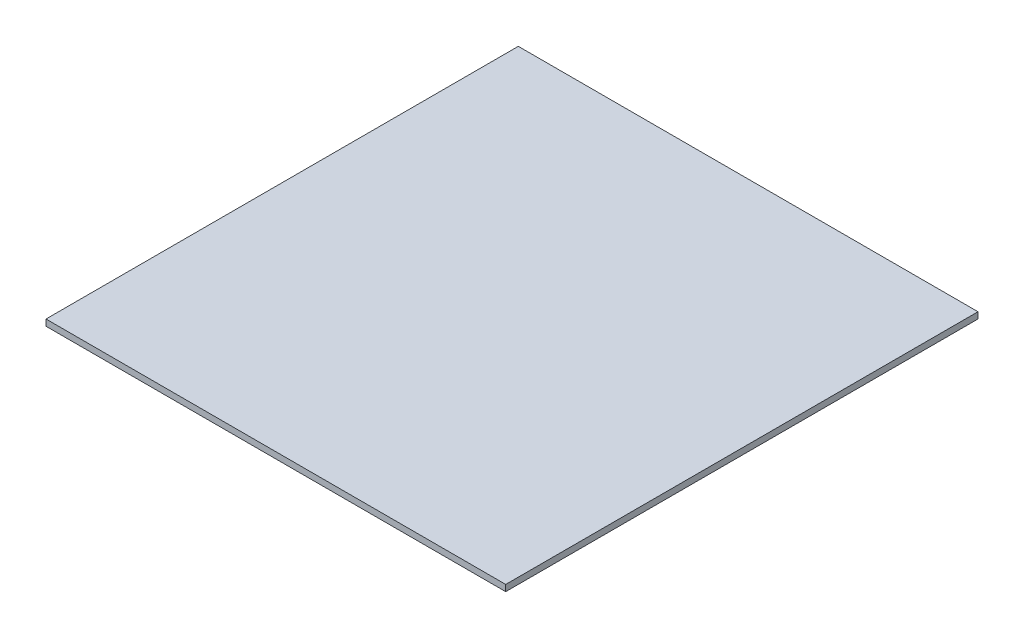
ISO-10303-21;
HEADER;
FILE_DESCRIPTION(('STEP AP214'),'2;1');
FILE_NAME('part.step','',(''),(''),'','','');
FILE_SCHEMA(('AUTOMOTIVE_DESIGN { 1 0 10303 214 1 1 1 1 }'));
ENDSEC;
DATA;
#1=APPLICATION_CONTEXT('core data for automotive mechanical design processes');
#2=APPLICATION_PROTOCOL_DEFINITION('international standard','automotive_design',2000,#1);
#3=PRODUCT_CONTEXT('',#1,'mechanical');
#4=PRODUCT('Part','Part','',(#3));
#5=PRODUCT_RELATED_PRODUCT_CATEGORY('part','',(#4));
#6=PRODUCT_DEFINITION_FORMATION('','',#4);
#7=PRODUCT_DEFINITION_CONTEXT('part definition',#1,'design');
#8=PRODUCT_DEFINITION('design','',#6,#7);
#9=PRODUCT_DEFINITION_SHAPE('','',#8);
#10=(LENGTH_UNIT() NAMED_UNIT(*) SI_UNIT(.MILLI.,.METRE.));
#11=(NAMED_UNIT(*) PLANE_ANGLE_UNIT() SI_UNIT($,.RADIAN.));
#12=(NAMED_UNIT(*) SI_UNIT($,.STERADIAN.) SOLID_ANGLE_UNIT());
#13=UNCERTAINTY_MEASURE_WITH_UNIT(LENGTH_MEASURE(1.E-05),#10,'distance_accuracy_value','');
#14=(GEOMETRIC_REPRESENTATION_CONTEXT(3) GLOBAL_UNCERTAINTY_ASSIGNED_CONTEXT((#13)) GLOBAL_UNIT_ASSIGNED_CONTEXT((#10,
#11,#12)) REPRESENTATION_CONTEXT('',''));
#15=CARTESIAN_POINT('',(0.,0.,0.));
#16=DIRECTION('',(0.,0.,1.));
#17=DIRECTION('',(1.,0.,0.));
#18=AXIS2_PLACEMENT_3D('',#15,#16,#17);
#19=CARTESIAN_POINT('',(0.,0.,0.));
#20=DIRECTION('',(0.,0.,-1.));
#21=DIRECTION('',(-1.,0.,0.));
#22=AXIS2_PLACEMENT_3D('',#19,#20,#21);
#23=PLANE('',#22);
#24=DIRECTION('',(0.,-1.,0.));
#25=VECTOR('',#24,1.);
#26=CARTESIAN_POINT('',(-73.,-75.,0.));
#27=LINE('',#26,#25);
#28=CARTESIAN_POINT('',(-73.,-73.,0.));
#29=VERTEX_POINT('',#28);
#30=CARTESIAN_POINT('',(-73.,-75.,0.));
#31=VERTEX_POINT('',#30);
#32=EDGE_CURVE('E82',#29,#31,#27,.T.);
#33=ORIENTED_EDGE('',*,*,#32,.F.);
#34=DIRECTION('',(-1.,0.,0.));
#35=VECTOR('',#34,1.);
#36=CARTESIAN_POINT('',(-73.,-73.,0.));
#37=LINE('',#36,#35);
#38=CARTESIAN_POINT('',(73.,-73.,0.));
#39=VERTEX_POINT('',#38);
#40=EDGE_CURVE('E93',#39,#29,#37,.T.);
#41=ORIENTED_EDGE('',*,*,#40,.F.);
#42=DIRECTION('',(0.,1.,0.));
#43=VECTOR('',#42,1.);
#44=CARTESIAN_POINT('',(73.,-75.,0.));
#45=LINE('',#44,#43);
#46=CARTESIAN_POINT('',(73.,-75.,0.));
#47=VERTEX_POINT('',#46);
#48=EDGE_CURVE('E84',#47,#39,#45,.T.);
#49=ORIENTED_EDGE('',*,*,#48,.F.);
#50=DIRECTION('',(1.,0.,0.));
#51=VECTOR('',#50,1.);
#52=CARTESIAN_POINT('',(-73.,-75.,0.));
#53=LINE('',#52,#51);
#54=EDGE_CURVE('E74',#31,#47,#53,.T.);
#55=ORIENTED_EDGE('',*,*,#54,.F.);
#56=EDGE_LOOP('',(#33,#41,#49,#55));
#57=FACE_BOUND('',#56,.T.);
#58=ADVANCED_FACE('F32',(#57),#23,.T.);
#59=CARTESIAN_POINT('',(-73.,-73.,296.013697987552));
#60=DIRECTION('',(0.,-1.,0.));
#61=DIRECTION('',(0.,0.,-1.));
#62=AXIS2_PLACEMENT_3D('',#59,#60,#61);
#63=PLANE('',#62);
#64=DIRECTION('',(0.,0.,-1.));
#65=VECTOR('',#64,1.);
#66=CARTESIAN_POINT('',(-73.,-73.,296.013697987552));
#67=LINE('',#66,#65);
#68=CARTESIAN_POINT('',(-73.,-73.,150.));
#69=VERTEX_POINT('',#68);
#70=EDGE_CURVE('E87',#69,#29,#67,.T.);
#71=ORIENTED_EDGE('',*,*,#70,.F.);
#72=DIRECTION('',(1.,0.,0.));
#73=VECTOR('',#72,1.);
#74=CARTESIAN_POINT('',(-73.,-73.,150.));
#75=LINE('',#74,#73);
#76=CARTESIAN_POINT('',(73.,-73.,150.));
#77=VERTEX_POINT('',#76);
#78=EDGE_CURVE('E36',#69,#77,#75,.T.);
#79=ORIENTED_EDGE('',*,*,#78,.T.);
#80=DIRECTION('',(0.,0.,-1.));
#81=VECTOR('',#80,1.);
#82=CARTESIAN_POINT('',(73.,-73.,296.013697987552));
#83=LINE('',#82,#81);
#84=EDGE_CURVE('E96',#77,#39,#83,.T.);
#85=ORIENTED_EDGE('',*,*,#84,.T.);
#86=ORIENTED_EDGE('',*,*,#40,.T.);
#87=EDGE_LOOP('',(#71,#79,#85,#86));
#88=FACE_BOUND('',#87,.T.);
#89=ADVANCED_FACE('F105',(#88),#63,.F.);
#90=CARTESIAN_POINT('',(73.,-75.,296.013697987552));
#91=DIRECTION('',(-1.,0.,0.));
#92=DIRECTION('',(0.,0.,1.));
#93=AXIS2_PLACEMENT_3D('',#90,#91,#92);
#94=PLANE('',#93);
#95=ORIENTED_EDGE('',*,*,#84,.F.);
#96=DIRECTION('',(0.,-1.,0.));
#97=VECTOR('',#96,1.);
#98=CARTESIAN_POINT('',(73.,-75.,150.));
#99=LINE('',#98,#97);
#100=CARTESIAN_POINT('',(73.,-75.,150.));
#101=VERTEX_POINT('',#100);
#102=EDGE_CURVE('E102',#77,#101,#99,.T.);
#103=ORIENTED_EDGE('',*,*,#102,.T.);
#104=DIRECTION('',(0.,0.,-1.));
#105=VECTOR('',#104,1.);
#106=CARTESIAN_POINT('',(73.,-75.,296.013697987552));
#107=LINE('',#106,#105);
#108=EDGE_CURVE('E78',#101,#47,#107,.T.);
#109=ORIENTED_EDGE('',*,*,#108,.T.);
#110=ORIENTED_EDGE('',*,*,#48,.T.);
#111=EDGE_LOOP('',(#95,#103,#109,#110));
#112=FACE_BOUND('',#111,.T.);
#113=ADVANCED_FACE('F101',(#112),#94,.F.);
#114=CARTESIAN_POINT('',(-73.,-75.,296.013697987552));
#115=DIRECTION('',(0.,1.,0.));
#116=DIRECTION('',(0.,0.,1.));
#117=AXIS2_PLACEMENT_3D('',#114,#115,#116);
#118=PLANE('',#117);
#119=ORIENTED_EDGE('',*,*,#108,.F.);
#120=DIRECTION('',(-1.,0.,0.));
#121=VECTOR('',#120,1.);
#122=CARTESIAN_POINT('',(-73.,-75.,150.));
#123=LINE('',#122,#121);
#124=CARTESIAN_POINT('',(-73.,-75.,150.));
#125=VERTEX_POINT('',#124);
#126=EDGE_CURVE('E41',#101,#125,#123,.T.);
#127=ORIENTED_EDGE('',*,*,#126,.T.);
#128=DIRECTION('',(0.,0.,-1.));
#129=VECTOR('',#128,1.);
#130=CARTESIAN_POINT('',(-73.,-75.,296.013697987552));
#131=LINE('',#130,#129);
#132=EDGE_CURVE('E71',#125,#31,#131,.T.);
#133=ORIENTED_EDGE('',*,*,#132,.T.);
#134=ORIENTED_EDGE('',*,*,#54,.T.);
#135=EDGE_LOOP('',(#119,#127,#133,#134));
#136=FACE_BOUND('',#135,.T.);
#137=ADVANCED_FACE('F73',(#136),#118,.F.);
#138=CARTESIAN_POINT('',(-73.,-75.,296.013697987552));
#139=DIRECTION('',(1.,0.,0.));
#140=DIRECTION('',(0.,0.,-1.));
#141=AXIS2_PLACEMENT_3D('',#138,#139,#140);
#142=PLANE('',#141);
#143=ORIENTED_EDGE('',*,*,#132,.F.);
#144=DIRECTION('',(0.,1.,0.));
#145=VECTOR('',#144,1.);
#146=CARTESIAN_POINT('',(-73.,-75.,150.));
#147=LINE('',#146,#145);
#148=EDGE_CURVE('E11',#125,#69,#147,.T.);
#149=ORIENTED_EDGE('',*,*,#148,.T.);
#150=ORIENTED_EDGE('',*,*,#70,.T.);
#151=ORIENTED_EDGE('',*,*,#32,.T.);
#152=EDGE_LOOP('',(#143,#149,#150,#151));
#153=FACE_BOUND('',#152,.T.);
#154=ADVANCED_FACE('F34',(#153),#142,.F.);
#155=CARTESIAN_POINT('',(0.,0.,150.));
#156=DIRECTION('',(0.,0.,-1.));
#157=DIRECTION('',(-1.,0.,0.));
#158=AXIS2_PLACEMENT_3D('',#155,#156,#157);
#159=PLANE('',#158);
#160=ORIENTED_EDGE('',*,*,#126,.F.);
#161=ORIENTED_EDGE('',*,*,#102,.F.);
#162=ORIENTED_EDGE('',*,*,#78,.F.);
#163=ORIENTED_EDGE('',*,*,#148,.F.);
#164=EDGE_LOOP('',(#160,#161,#162,#163));
#165=FACE_BOUND('',#164,.T.);
#166=ADVANCED_FACE('F119',(#165),#159,.F.);
#167=CLOSED_SHELL('',(#58,#89,#113,#137,#154,#166));
#168=MANIFOLD_SOLID_BREP('B2',#167);
#169=ADVANCED_BREP_SHAPE_REPRESENTATION('',(#18,#168),#14);
#170=SHAPE_DEFINITION_REPRESENTATION(#9,#169);
ENDSEC;
END-ISO-10303-21;
